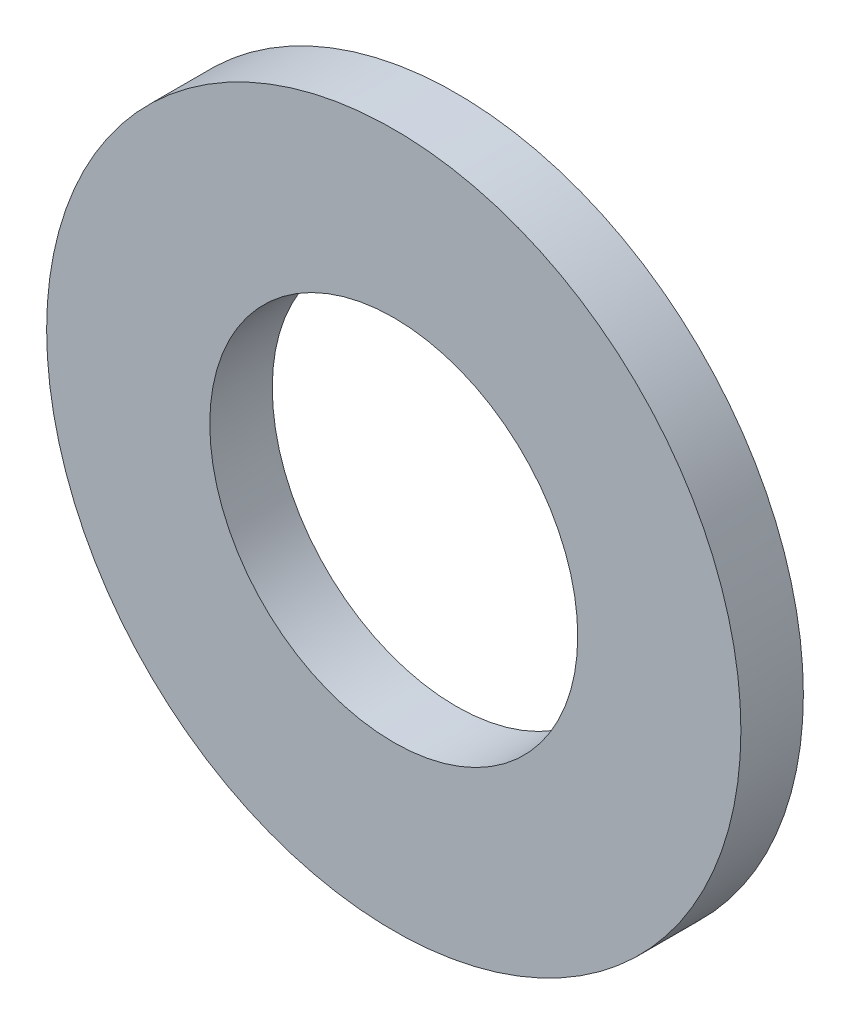
ISO-10303-21;
HEADER;
FILE_DESCRIPTION(('STEP AP214'),'2;1');
FILE_NAME('part.step','',(''),(''),'','','');
FILE_SCHEMA(('AUTOMOTIVE_DESIGN { 1 0 10303 214 1 1 1 1 }'));
ENDSEC;
DATA;
#1=APPLICATION_CONTEXT('core data for automotive mechanical design processes');
#2=APPLICATION_PROTOCOL_DEFINITION('international standard','automotive_design',2000,#1);
#3=PRODUCT_CONTEXT('',#1,'mechanical');
#4=PRODUCT('Part','Part','',(#3));
#5=PRODUCT_RELATED_PRODUCT_CATEGORY('part','',(#4));
#6=PRODUCT_DEFINITION_FORMATION('','',#4);
#7=PRODUCT_DEFINITION_CONTEXT('part definition',#1,'design');
#8=PRODUCT_DEFINITION('design','',#6,#7);
#9=PRODUCT_DEFINITION_SHAPE('','',#8);
#10=(LENGTH_UNIT() NAMED_UNIT(*) SI_UNIT(.MILLI.,.METRE.));
#11=(NAMED_UNIT(*) PLANE_ANGLE_UNIT() SI_UNIT($,.RADIAN.));
#12=(NAMED_UNIT(*) SI_UNIT($,.STERADIAN.) SOLID_ANGLE_UNIT());
#13=UNCERTAINTY_MEASURE_WITH_UNIT(LENGTH_MEASURE(1.E-05),#10,'distance_accuracy_value','');
#14=(GEOMETRIC_REPRESENTATION_CONTEXT(3) GLOBAL_UNCERTAINTY_ASSIGNED_CONTEXT((#13)) GLOBAL_UNIT_ASSIGNED_CONTEXT((#10,
#11,#12)) REPRESENTATION_CONTEXT('',''));
#15=CARTESIAN_POINT('',(0.,0.,0.));
#16=DIRECTION('',(0.,0.,1.));
#17=DIRECTION('',(1.,0.,0.));
#18=AXIS2_PLACEMENT_3D('',#15,#16,#17);
#19=CARTESIAN_POINT('',(0.,0.,-0.9));
#20=DIRECTION('',(0.,0.,1.));
#21=DIRECTION('',(1.,0.,0.));
#22=AXIS2_PLACEMENT_3D('',#19,#20,#21);
#23=CYLINDRICAL_SURFACE('',#22,5.);
#24=CARTESIAN_POINT('',(0.,0.,-0.9));
#25=DIRECTION('',(0.,0.,1.));
#26=DIRECTION('',(1.,0.,0.));
#27=AXIS2_PLACEMENT_3D('',#24,#25,#26);
#28=CIRCLE('',#27,5.);
#29=CARTESIAN_POINT('',(5.,0.,-0.9));
#30=VERTEX_POINT('',#29);
#31=EDGE_CURVE('E10',#30,#30,#28,.T.);
#32=ORIENTED_EDGE('',*,*,#31,.T.);
#33=EDGE_LOOP('',(#32));
#34=FACE_BOUND('',#33,.T.);
#35=CARTESIAN_POINT('',(0.,0.,0.));
#36=DIRECTION('',(0.,0.,1.));
#37=DIRECTION('',(1.,0.,0.));
#38=AXIS2_PLACEMENT_3D('',#35,#36,#37);
#39=CIRCLE('',#38,5.);
#40=CARTESIAN_POINT('',(5.,0.,0.));
#41=VERTEX_POINT('',#40);
#42=EDGE_CURVE('E33',#41,#41,#39,.T.);
#43=ORIENTED_EDGE('',*,*,#42,.F.);
#44=EDGE_LOOP('',(#43));
#45=FACE_BOUND('',#44,.T.);
#46=ADVANCED_FACE('F30',(#34,#45),#23,.T.);
#47=CARTESIAN_POINT('',(0.,0.,-0.9));
#48=DIRECTION('',(0.,0.,1.));
#49=DIRECTION('',(1.,0.,0.));
#50=AXIS2_PLACEMENT_3D('',#47,#48,#49);
#51=PLANE('',#50);
#52=CARTESIAN_POINT('',(0.,0.,-0.9));
#53=DIRECTION('',(0.,0.,1.));
#54=DIRECTION('',(1.,0.,0.));
#55=AXIS2_PLACEMENT_3D('',#52,#53,#54);
#56=CIRCLE('',#55,2.65);
#57=CARTESIAN_POINT('',(2.65,0.,-0.9));
#58=VERTEX_POINT('',#57);
#59=EDGE_CURVE('E40',#58,#58,#56,.T.);
#60=ORIENTED_EDGE('',*,*,#59,.T.);
#61=EDGE_LOOP('',(#60));
#62=FACE_BOUND('',#61,.T.);
#63=ORIENTED_EDGE('',*,*,#31,.F.);
#64=EDGE_LOOP('',(#63));
#65=FACE_BOUND('',#64,.T.);
#66=ADVANCED_FACE('F48',(#62,#65),#51,.F.);
#67=CARTESIAN_POINT('',(0.,0.,0.));
#68=DIRECTION('',(0.,0.,1.));
#69=DIRECTION('',(1.,0.,0.));
#70=AXIS2_PLACEMENT_3D('',#67,#68,#69);
#71=PLANE('',#70);
#72=CARTESIAN_POINT('',(0.,0.,0.));
#73=DIRECTION('',(0.,0.,1.));
#74=DIRECTION('',(1.,0.,0.));
#75=AXIS2_PLACEMENT_3D('',#72,#73,#74);
#76=CIRCLE('',#75,2.65);
#77=CARTESIAN_POINT('',(2.65,0.,0.));
#78=VERTEX_POINT('',#77);
#79=EDGE_CURVE('E42',#78,#78,#76,.T.);
#80=ORIENTED_EDGE('',*,*,#79,.F.);
#81=EDGE_LOOP('',(#80));
#82=FACE_BOUND('',#81,.T.);
#83=ORIENTED_EDGE('',*,*,#42,.T.);
#84=EDGE_LOOP('',(#83));
#85=FACE_BOUND('',#84,.T.);
#86=ADVANCED_FACE('F54',(#82,#85),#71,.T.);
#87=CARTESIAN_POINT('',(0.,0.,-0.9));
#88=DIRECTION('',(0.,0.,1.));
#89=DIRECTION('',(1.,0.,0.));
#90=AXIS2_PLACEMENT_3D('',#87,#88,#89);
#91=CYLINDRICAL_SURFACE('',#90,2.65);
#92=ORIENTED_EDGE('',*,*,#59,.F.);
#93=EDGE_LOOP('',(#92));
#94=FACE_BOUND('',#93,.T.);
#95=ORIENTED_EDGE('',*,*,#79,.T.);
#96=EDGE_LOOP('',(#95));
#97=FACE_BOUND('',#96,.T.);
#98=ADVANCED_FACE('F51',(#94,#97),#91,.F.);
#99=CLOSED_SHELL('',(#46,#66,#86,#98));
#100=MANIFOLD_SOLID_BREP('B2',#99);
#101=ADVANCED_BREP_SHAPE_REPRESENTATION('',(#18,#100),#14);
#102=SHAPE_DEFINITION_REPRESENTATION(#9,#101);
ENDSEC;
END-ISO-10303-21;
